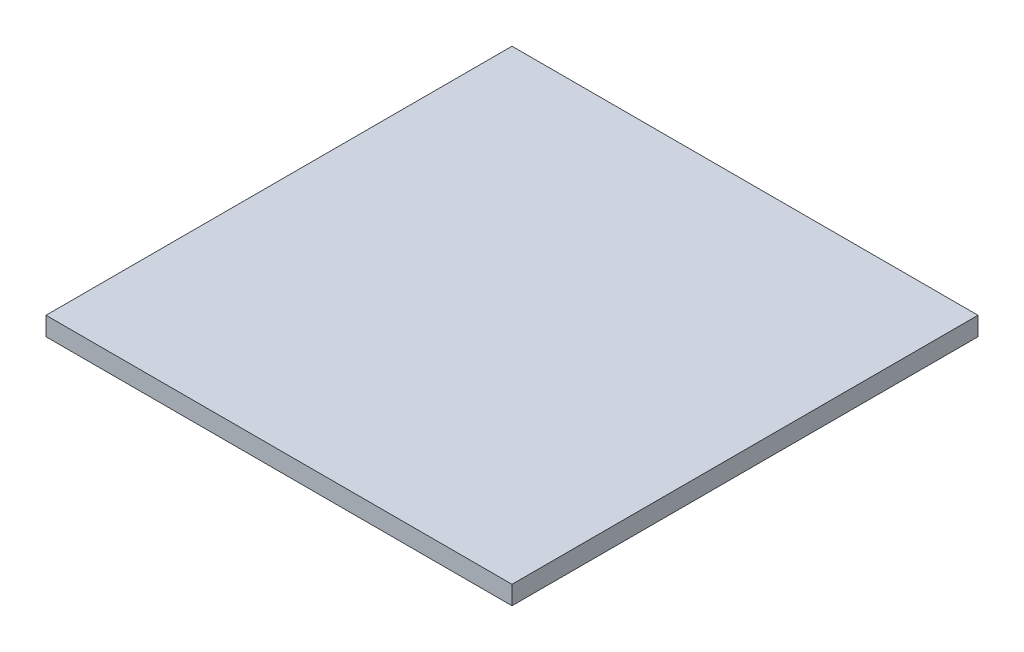
ISO-10303-21;
HEADER;
FILE_DESCRIPTION(('STEP AP214'),'2;1');
FILE_NAME('part.step','',(''),(''),'','','');
FILE_SCHEMA(('AUTOMOTIVE_DESIGN { 1 0 10303 214 1 1 1 1 }'));
ENDSEC;
DATA;
#1=APPLICATION_CONTEXT('core data for automotive mechanical design processes');
#2=APPLICATION_PROTOCOL_DEFINITION('international standard','automotive_design',2000,#1);
#3=PRODUCT_CONTEXT('',#1,'mechanical');
#4=PRODUCT('Part','Part','',(#3));
#5=PRODUCT_RELATED_PRODUCT_CATEGORY('part','',(#4));
#6=PRODUCT_DEFINITION_FORMATION('','',#4);
#7=PRODUCT_DEFINITION_CONTEXT('part definition',#1,'design');
#8=PRODUCT_DEFINITION('design','',#6,#7);
#9=PRODUCT_DEFINITION_SHAPE('','',#8);
#10=(LENGTH_UNIT() NAMED_UNIT(*) SI_UNIT(.MILLI.,.METRE.));
#11=(NAMED_UNIT(*) PLANE_ANGLE_UNIT() SI_UNIT($,.RADIAN.));
#12=(NAMED_UNIT(*) SI_UNIT($,.STERADIAN.) SOLID_ANGLE_UNIT());
#13=UNCERTAINTY_MEASURE_WITH_UNIT(LENGTH_MEASURE(1.E-05),#10,'distance_accuracy_value','');
#14=(GEOMETRIC_REPRESENTATION_CONTEXT(3) GLOBAL_UNCERTAINTY_ASSIGNED_CONTEXT((#13)) GLOBAL_UNIT_ASSIGNED_CONTEXT((#10,
#11,#12)) REPRESENTATION_CONTEXT('',''));
#15=CARTESIAN_POINT('',(0.,0.,0.));
#16=DIRECTION('',(0.,0.,1.));
#17=DIRECTION('',(1.,0.,0.));
#18=AXIS2_PLACEMENT_3D('',#15,#16,#17);
#19=CARTESIAN_POINT('',(-2.5,0.2,-2.5));
#20=DIRECTION('',(1.,0.,0.));
#21=DIRECTION('',(0.,0.,-1.));
#22=AXIS2_PLACEMENT_3D('',#19,#20,#21);
#23=PLANE('',#22);
#24=DIRECTION('',(0.,0.,1.));
#25=VECTOR('',#24,1.);
#26=CARTESIAN_POINT('',(-2.5,0.,-2.5));
#27=LINE('',#26,#25);
#28=CARTESIAN_POINT('',(-2.5,0.,-2.5));
#29=VERTEX_POINT('',#28);
#30=CARTESIAN_POINT('',(-2.5,0.,2.5));
#31=VERTEX_POINT('',#30);
#32=EDGE_CURVE('E96',#29,#31,#27,.T.);
#33=ORIENTED_EDGE('',*,*,#32,.T.);
#34=DIRECTION('',(0.,-1.,0.));
#35=VECTOR('',#34,1.);
#36=CARTESIAN_POINT('',(-2.5,0.2,2.5));
#37=LINE('',#36,#35);
#38=CARTESIAN_POINT('',(-2.5,0.2,2.5));
#39=VERTEX_POINT('',#38);
#40=EDGE_CURVE('E11',#39,#31,#37,.T.);
#41=ORIENTED_EDGE('',*,*,#40,.F.);
#42=DIRECTION('',(0.,0.,1.));
#43=VECTOR('',#42,1.);
#44=CARTESIAN_POINT('',(-2.5,0.2,-2.5));
#45=LINE('',#44,#43);
#46=CARTESIAN_POINT('',(-2.5,0.2,-2.5));
#47=VERTEX_POINT('',#46);
#48=EDGE_CURVE('E84',#47,#39,#45,.T.);
#49=ORIENTED_EDGE('',*,*,#48,.F.);
#50=DIRECTION('',(0.,-1.,0.));
#51=VECTOR('',#50,1.);
#52=CARTESIAN_POINT('',(-2.5,0.2,-2.5));
#53=LINE('',#52,#51);
#54=EDGE_CURVE('E92',#47,#29,#53,.T.);
#55=ORIENTED_EDGE('',*,*,#54,.T.);
#56=EDGE_LOOP('',(#33,#41,#49,#55));
#57=FACE_BOUND('',#56,.T.);
#58=ADVANCED_FACE('F33',(#57),#23,.F.);
#59=CARTESIAN_POINT('',(-2.5,0.2,2.5));
#60=DIRECTION('',(0.,0.,-1.));
#61=DIRECTION('',(-1.,0.,0.));
#62=AXIS2_PLACEMENT_3D('',#59,#60,#61);
#63=PLANE('',#62);
#64=DIRECTION('',(1.,0.,0.));
#65=VECTOR('',#64,1.);
#66=CARTESIAN_POINT('',(-2.5,0.,2.5));
#67=LINE('',#66,#65);
#68=CARTESIAN_POINT('',(2.5,0.,2.5));
#69=VERTEX_POINT('',#68);
#70=EDGE_CURVE('E88',#31,#69,#67,.T.);
#71=ORIENTED_EDGE('',*,*,#70,.T.);
#72=DIRECTION('',(0.,-1.,0.));
#73=VECTOR('',#72,1.);
#74=CARTESIAN_POINT('',(2.5,0.2,2.5));
#75=LINE('',#74,#73);
#76=CARTESIAN_POINT('',(2.5,0.2,2.5));
#77=VERTEX_POINT('',#76);
#78=EDGE_CURVE('E41',#77,#69,#75,.T.);
#79=ORIENTED_EDGE('',*,*,#78,.F.);
#80=DIRECTION('',(1.,0.,0.));
#81=VECTOR('',#80,1.);
#82=CARTESIAN_POINT('',(-2.5,0.2,2.5));
#83=LINE('',#82,#81);
#84=EDGE_CURVE('E79',#39,#77,#83,.T.);
#85=ORIENTED_EDGE('',*,*,#84,.F.);
#86=ORIENTED_EDGE('',*,*,#40,.T.);
#87=EDGE_LOOP('',(#71,#79,#85,#86));
#88=FACE_BOUND('',#87,.T.);
#89=ADVANCED_FACE('F87',(#88),#63,.F.);
#90=CARTESIAN_POINT('',(2.5,0.2,-2.5));
#91=DIRECTION('',(-1.,0.,0.));
#92=DIRECTION('',(0.,0.,1.));
#93=AXIS2_PLACEMENT_3D('',#90,#91,#92);
#94=PLANE('',#93);
#95=DIRECTION('',(0.,0.,-1.));
#96=VECTOR('',#95,1.);
#97=CARTESIAN_POINT('',(2.5,0.,-2.5));
#98=LINE('',#97,#96);
#99=CARTESIAN_POINT('',(2.5,0.,-2.5));
#100=VERTEX_POINT('',#99);
#101=EDGE_CURVE('E66',#69,#100,#98,.T.);
#102=ORIENTED_EDGE('',*,*,#101,.T.);
#103=DIRECTION('',(0.,-1.,0.));
#104=VECTOR('',#103,1.);
#105=CARTESIAN_POINT('',(2.5,0.2,-2.5));
#106=LINE('',#105,#104);
#107=CARTESIAN_POINT('',(2.5,0.2,-2.5));
#108=VERTEX_POINT('',#107);
#109=EDGE_CURVE('E89',#108,#100,#106,.T.);
#110=ORIENTED_EDGE('',*,*,#109,.F.);
#111=DIRECTION('',(0.,0.,-1.));
#112=VECTOR('',#111,1.);
#113=CARTESIAN_POINT('',(2.5,0.2,-2.5));
#114=LINE('',#113,#112);
#115=EDGE_CURVE('E82',#77,#108,#114,.T.);
#116=ORIENTED_EDGE('',*,*,#115,.F.);
#117=ORIENTED_EDGE('',*,*,#78,.T.);
#118=EDGE_LOOP('',(#102,#110,#116,#117));
#119=FACE_BOUND('',#118,.T.);
#120=ADVANCED_FACE('F90',(#119),#94,.F.);
#121=CARTESIAN_POINT('',(-2.5,0.2,-2.5));
#122=DIRECTION('',(0.,0.,1.));
#123=DIRECTION('',(1.,0.,0.));
#124=AXIS2_PLACEMENT_3D('',#121,#122,#123);
#125=PLANE('',#124);
#126=DIRECTION('',(-1.,0.,0.));
#127=VECTOR('',#126,1.);
#128=CARTESIAN_POINT('',(-2.5,0.,-2.5));
#129=LINE('',#128,#127);
#130=EDGE_CURVE('E72',#100,#29,#129,.T.);
#131=ORIENTED_EDGE('',*,*,#130,.T.);
#132=ORIENTED_EDGE('',*,*,#54,.F.);
#133=DIRECTION('',(-1.,0.,0.));
#134=VECTOR('',#133,1.);
#135=CARTESIAN_POINT('',(-2.5,0.2,-2.5));
#136=LINE('',#135,#134);
#137=EDGE_CURVE('E49',#108,#47,#136,.T.);
#138=ORIENTED_EDGE('',*,*,#137,.F.);
#139=ORIENTED_EDGE('',*,*,#109,.T.);
#140=EDGE_LOOP('',(#131,#132,#138,#139));
#141=FACE_BOUND('',#140,.T.);
#142=ADVANCED_FACE('F103',(#141),#125,.F.);
#143=CARTESIAN_POINT('',(0.,0.2,0.));
#144=DIRECTION('',(0.,1.,0.));
#145=DIRECTION('',(0.,0.,1.));
#146=AXIS2_PLACEMENT_3D('',#143,#144,#145);
#147=PLANE('',#146);
#148=ORIENTED_EDGE('',*,*,#48,.T.);
#149=ORIENTED_EDGE('',*,*,#84,.T.);
#150=ORIENTED_EDGE('',*,*,#115,.T.);
#151=ORIENTED_EDGE('',*,*,#137,.T.);
#152=EDGE_LOOP('',(#148,#149,#150,#151));
#153=FACE_BOUND('',#152,.T.);
#154=ADVANCED_FACE('F80',(#153),#147,.T.);
#155=CARTESIAN_POINT('',(0.,0.,0.));
#156=DIRECTION('',(0.,1.,0.));
#157=DIRECTION('',(0.,0.,1.));
#158=AXIS2_PLACEMENT_3D('',#155,#156,#157);
#159=PLANE('',#158);
#160=ORIENTED_EDGE('',*,*,#32,.F.);
#161=ORIENTED_EDGE('',*,*,#130,.F.);
#162=ORIENTED_EDGE('',*,*,#101,.F.);
#163=ORIENTED_EDGE('',*,*,#70,.F.);
#164=EDGE_LOOP('',(#160,#161,#162,#163));
#165=FACE_BOUND('',#164,.T.);
#166=ADVANCED_FACE('F106',(#165),#159,.F.);
#167=CLOSED_SHELL('',(#58,#89,#120,#142,#154,#166));
#168=MANIFOLD_SOLID_BREP('B2',#167);
#169=ADVANCED_BREP_SHAPE_REPRESENTATION('',(#18,#168),#14);
#170=SHAPE_DEFINITION_REPRESENTATION(#9,#169);
ENDSEC;
END-ISO-10303-21;
